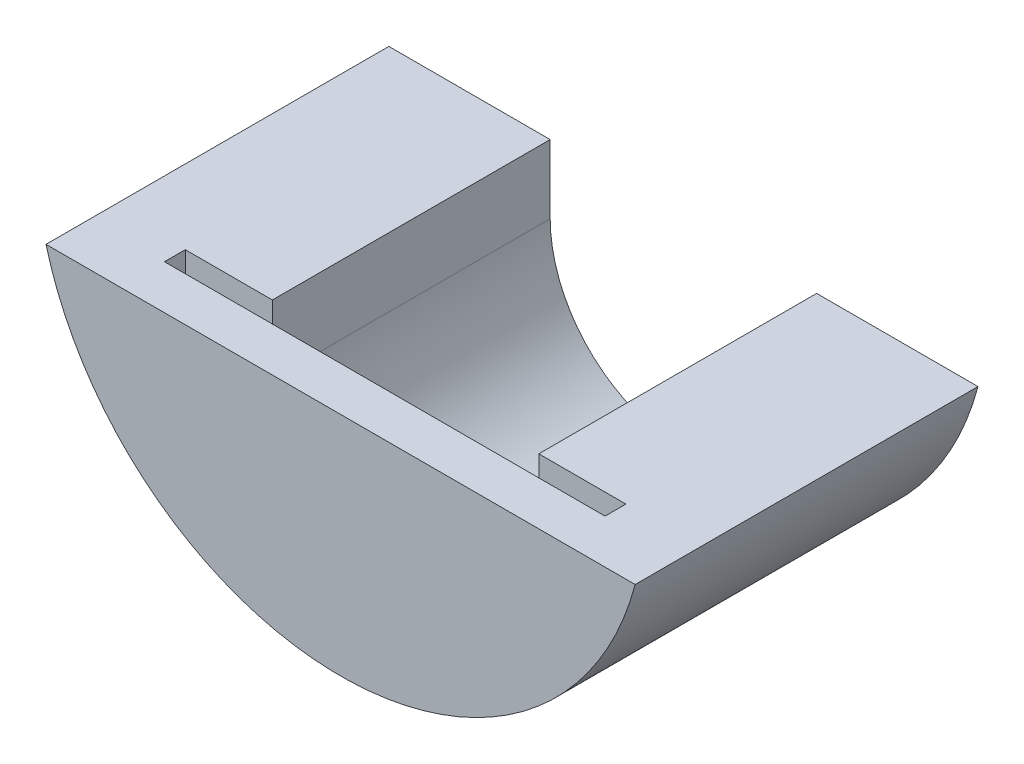
ISO-10303-21;
HEADER;
FILE_DESCRIPTION(('STEP AP214'),'2;1');
FILE_NAME('part.step','',(''),(''),'','','');
FILE_SCHEMA(('AUTOMOTIVE_DESIGN { 1 0 10303 214 1 1 1 1 }'));
ENDSEC;
DATA;
#1=APPLICATION_CONTEXT('core data for automotive mechanical design processes');
#2=APPLICATION_PROTOCOL_DEFINITION('international standard','automotive_design',2000,#1);
#3=PRODUCT_CONTEXT('',#1,'mechanical');
#4=PRODUCT('Part','Part','',(#3));
#5=PRODUCT_RELATED_PRODUCT_CATEGORY('part','',(#4));
#6=PRODUCT_DEFINITION_FORMATION('','',#4);
#7=PRODUCT_DEFINITION_CONTEXT('part definition',#1,'design');
#8=PRODUCT_DEFINITION('design','',#6,#7);
#9=PRODUCT_DEFINITION_SHAPE('','',#8);
#10=(LENGTH_UNIT() NAMED_UNIT(*) SI_UNIT(.MILLI.,.METRE.));
#11=(NAMED_UNIT(*) PLANE_ANGLE_UNIT() SI_UNIT($,.RADIAN.));
#12=(NAMED_UNIT(*) SI_UNIT($,.STERADIAN.) SOLID_ANGLE_UNIT());
#13=UNCERTAINTY_MEASURE_WITH_UNIT(LENGTH_MEASURE(1.E-05),#10,'distance_accuracy_value','');
#14=(GEOMETRIC_REPRESENTATION_CONTEXT(3) GLOBAL_UNCERTAINTY_ASSIGNED_CONTEXT((#13)) GLOBAL_UNIT_ASSIGNED_CONTEXT((#10,
#11,#12)) REPRESENTATION_CONTEXT('',''));
#15=CARTESIAN_POINT('',(0.,0.,0.));
#16=DIRECTION('',(0.,0.,1.));
#17=DIRECTION('',(1.,0.,0.));
#18=AXIS2_PLACEMENT_3D('',#15,#16,#17);
#19=CARTESIAN_POINT('',(0.,0.,50.));
#20=DIRECTION('',(0.,0.,-1.));
#21=DIRECTION('',(-1.,0.,0.));
#22=AXIS2_PLACEMENT_3D('',#19,#20,#21);
#23=CYLINDRICAL_SURFACE('',#22,44.45);
#24=CARTESIAN_POINT('',(0.,0.,0.));
#25=DIRECTION('',(0.,0.,1.));
#26=DIRECTION('',(1.,0.,0.));
#27=AXIS2_PLACEMENT_3D('',#24,#25,#26);
#28=CIRCLE('',#27,44.45);
#29=CARTESIAN_POINT('',(-42.9632691959073,-11.4,0.));
#30=VERTEX_POINT('',#29);
#31=CARTESIAN_POINT('',(42.9632691959073,-11.4,0.));
#32=VERTEX_POINT('',#31);
#33=EDGE_CURVE('E144',#30,#32,#28,.T.);
#34=ORIENTED_EDGE('',*,*,#33,.T.);
#35=DIRECTION('',(0.,0.,-1.));
#36=VECTOR('',#35,1.);
#37=CARTESIAN_POINT('',(42.9632691959073,-11.4,50.));
#38=LINE('',#37,#36);
#39=CARTESIAN_POINT('',(42.9632691959073,-11.4,50.));
#40=VERTEX_POINT('',#39);
#41=EDGE_CURVE('E147',#40,#32,#38,.T.);
#42=ORIENTED_EDGE('',*,*,#41,.F.);
#43=CARTESIAN_POINT('',(0.,0.,50.));
#44=DIRECTION('',(0.,0.,1.));
#45=DIRECTION('',(1.,0.,0.));
#46=AXIS2_PLACEMENT_3D('',#43,#44,#45);
#47=CIRCLE('',#46,44.45);
#48=CARTESIAN_POINT('',(-42.9632691959073,-11.4,50.));
#49=VERTEX_POINT('',#48);
#50=EDGE_CURVE('E50',#49,#40,#47,.T.);
#51=ORIENTED_EDGE('',*,*,#50,.F.);
#52=DIRECTION('',(0.,0.,-1.));
#53=VECTOR('',#52,1.);
#54=CARTESIAN_POINT('',(-42.9632691959073,-11.4,50.));
#55=LINE('',#54,#53);
#56=EDGE_CURVE('E149',#49,#30,#55,.T.);
#57=ORIENTED_EDGE('',*,*,#56,.T.);
#58=EDGE_LOOP('',(#34,#42,#51,#57));
#59=FACE_BOUND('',#58,.T.);
#60=ADVANCED_FACE('F43',(#59),#23,.T.);
#61=CARTESIAN_POINT('',(0.,0.,50.));
#62=DIRECTION('',(0.,0.,1.));
#63=DIRECTION('',(1.,0.,0.));
#64=AXIS2_PLACEMENT_3D('',#61,#62,#63);
#65=PLANE('',#64);
#66=ORIENTED_EDGE('',*,*,#50,.T.);
#67=DIRECTION('',(1.,0.,0.));
#68=VECTOR('',#67,1.);
#69=CARTESIAN_POINT('',(-38.9594982000539,-11.4,50.));
#70=LINE('',#69,#68);
#71=EDGE_CURVE('E166',#49,#40,#70,.T.);
#72=ORIENTED_EDGE('',*,*,#71,.F.);
#73=EDGE_LOOP('',(#66,#72));
#74=FACE_BOUND('',#73,.T.);
#75=ADVANCED_FACE('F255',(#74),#65,.T.);
#76=CARTESIAN_POINT('',(0.,0.,0.));
#77=DIRECTION('',(0.,0.,1.));
#78=DIRECTION('',(1.,0.,0.));
#79=AXIS2_PLACEMENT_3D('',#76,#77,#78);
#80=PLANE('',#79);
#81=CARTESIAN_POINT('',(0.,-21.4,0.));
#82=DIRECTION('',(0.,0.,1.));
#83=DIRECTION('',(1.,0.,0.));
#84=AXIS2_PLACEMENT_3D('',#81,#82,#83);
#85=CIRCLE('',#84,19.431);
#86=CARTESIAN_POINT('',(19.431,-21.4,0.));
#87=VERTEX_POINT('',#86);
#88=CARTESIAN_POINT('',(-19.431,-21.4,0.));
#89=VERTEX_POINT('',#88);
#90=EDGE_CURVE('E11',#87,#89,#85,.F.);
#91=ORIENTED_EDGE('',*,*,#90,.F.);
#92=DIRECTION('',(0.,-1.,0.));
#93=VECTOR('',#92,1.);
#94=CARTESIAN_POINT('',(19.431,-11.4,0.));
#95=LINE('',#94,#93);
#96=CARTESIAN_POINT('',(19.431,-11.4,0.));
#97=VERTEX_POINT('',#96);
#98=EDGE_CURVE('E157',#97,#87,#95,.T.);
#99=ORIENTED_EDGE('',*,*,#98,.F.);
#100=DIRECTION('',(-1.,0.,0.));
#101=VECTOR('',#100,1.);
#102=CARTESIAN_POINT('',(38.9594982000539,-11.4,0.));
#103=LINE('',#102,#101);
#104=EDGE_CURVE('E154',#32,#97,#103,.T.);
#105=ORIENTED_EDGE('',*,*,#104,.F.);
#106=ORIENTED_EDGE('',*,*,#33,.F.);
#107=DIRECTION('',(-1.,0.,0.));
#108=VECTOR('',#107,1.);
#109=CARTESIAN_POINT('',(-19.431,-11.4,0.));
#110=LINE('',#109,#108);
#111=CARTESIAN_POINT('',(-19.431,-11.4,0.));
#112=VERTEX_POINT('',#111);
#113=EDGE_CURVE('E211',#112,#30,#110,.T.);
#114=ORIENTED_EDGE('',*,*,#113,.F.);
#115=DIRECTION('',(0.,-1.,0.));
#116=VECTOR('',#115,1.);
#117=CARTESIAN_POINT('',(-19.431,-11.4,0.));
#118=LINE('',#117,#116);
#119=EDGE_CURVE('E214',#112,#89,#118,.T.);
#120=ORIENTED_EDGE('',*,*,#119,.T.);
#121=EDGE_LOOP('',(#91,#99,#105,#106,#114,#120));
#122=FACE_BOUND('',#121,.T.);
#123=ADVANCED_FACE('F156',(#122),#80,.F.);
#124=CARTESIAN_POINT('',(0.,-21.4,41.5400000000001));
#125=DIRECTION('',(0.,0.,-1.));
#126=DIRECTION('',(-1.,0.,0.));
#127=AXIS2_PLACEMENT_3D('',#124,#125,#126);
#128=CYLINDRICAL_SURFACE('',#127,19.431);
#129=DIRECTION('',(0.,0.,-1.));
#130=VECTOR('',#129,1.);
#131=CARTESIAN_POINT('',(19.431,-21.4,50.));
#132=LINE('',#131,#130);
#133=CARTESIAN_POINT('',(19.431,-21.4,40.5200000000001));
#134=VERTEX_POINT('',#133);
#135=EDGE_CURVE('E224',#134,#87,#132,.T.);
#136=ORIENTED_EDGE('',*,*,#135,.T.);
#137=ORIENTED_EDGE('',*,*,#90,.T.);
#138=DIRECTION('',(0.,0.,-1.));
#139=VECTOR('',#138,1.);
#140=CARTESIAN_POINT('',(-19.431,-21.4,50.));
#141=LINE('',#140,#139);
#142=CARTESIAN_POINT('',(-19.431,-21.4,40.5200000000001));
#143=VERTEX_POINT('',#142);
#144=EDGE_CURVE('E223',#143,#89,#141,.T.);
#145=ORIENTED_EDGE('',*,*,#144,.F.);
#146=CARTESIAN_POINT('',(0.,-21.4,40.5200000000001));
#147=DIRECTION('',(0.,0.,1.));
#148=DIRECTION('',(1.,0.,0.));
#149=AXIS2_PLACEMENT_3D('',#146,#147,#148);
#150=CIRCLE('',#149,19.431);
#151=EDGE_CURVE('E152',#143,#134,#150,.T.);
#152=ORIENTED_EDGE('',*,*,#151,.T.);
#153=EDGE_LOOP('',(#136,#137,#145,#152));
#154=FACE_BOUND('',#153,.T.);
#155=ADVANCED_FACE('F263',(#154),#128,.F.);
#156=CARTESIAN_POINT('',(-15.555,-21.4,42.5600000000001));
#157=DIRECTION('',(0.,0.,-1.));
#158=DIRECTION('',(-1.,0.,0.));
#159=AXIS2_PLACEMENT_3D('',#156,#157,#158);
#160=CYLINDRICAL_SURFACE('',#159,16.575);
#161=DIRECTION('',(0.,0.,-1.));
#162=VECTOR('',#161,1.);
#163=CARTESIAN_POINT('',(-32.13,-21.4,42.5600000000001));
#164=LINE('',#163,#162);
#165=CARTESIAN_POINT('',(-32.13,-21.4,43.5600000000001));
#166=VERTEX_POINT('',#165);
#167=CARTESIAN_POINT('',(-32.13,-21.4,40.5200000000001));
#168=VERTEX_POINT('',#167);
#169=EDGE_CURVE('E227',#166,#168,#164,.T.);
#170=ORIENTED_EDGE('',*,*,#169,.F.);
#171=CARTESIAN_POINT('',(-15.555,-21.4,43.5600000000001));
#172=DIRECTION('',(0.,0.,-1.));
#173=DIRECTION('',(-1.,0.,0.));
#174=AXIS2_PLACEMENT_3D('',#171,#172,#173);
#175=CIRCLE('',#174,16.575);
#176=CARTESIAN_POINT('',(-21.93,-36.7,43.5600000000001));
#177=VERTEX_POINT('',#176);
#178=EDGE_CURVE('E186',#177,#166,#175,.T.);
#179=ORIENTED_EDGE('',*,*,#178,.F.);
#180=DIRECTION('',(0.,0.,-1.));
#181=VECTOR('',#180,1.);
#182=CARTESIAN_POINT('',(-21.93,-36.7,42.5600000000001));
#183=LINE('',#182,#181);
#184=CARTESIAN_POINT('',(-21.93,-36.7,40.5200000000001));
#185=VERTEX_POINT('',#184);
#186=EDGE_CURVE('E250',#177,#185,#183,.T.);
#187=ORIENTED_EDGE('',*,*,#186,.T.);
#188=CARTESIAN_POINT('',(-15.555,-21.4,40.5200000000001));
#189=DIRECTION('',(0.,0.,1.));
#190=DIRECTION('',(1.,0.,0.));
#191=AXIS2_PLACEMENT_3D('',#188,#189,#190);
#192=CIRCLE('',#191,16.575);
#193=EDGE_CURVE('E57',#168,#185,#192,.T.);
#194=ORIENTED_EDGE('',*,*,#193,.F.);
#195=EDGE_LOOP('',(#170,#179,#187,#194));
#196=FACE_BOUND('',#195,.T.);
#197=ADVANCED_FACE('F286',(#196),#160,.F.);
#198=CARTESIAN_POINT('',(-6.81688082386147,-41.7601074857985,42.5600000000001));
#199=DIRECTION('',(0.31749247002289,0.94826079296719,0.));
#200=DIRECTION('',(-0.94826079296719,0.31749247002289,0.));
#201=AXIS2_PLACEMENT_3D('',#198,#199,#200);
#202=PLANE('',#201);
#203=ORIENTED_EDGE('',*,*,#186,.F.);
#204=DIRECTION('',(-0.94826079296719,0.317492470022889,0.));
#205=VECTOR('',#204,1.);
#206=CARTESIAN_POINT('',(-6.81688082386148,-41.7601074857985,43.5600000000001));
#207=LINE('',#206,#205);
#208=CARTESIAN_POINT('',(-6.81688082386147,-41.7601074857985,43.5600000000001));
#209=VERTEX_POINT('',#208);
#210=EDGE_CURVE('E183',#209,#177,#207,.T.);
#211=ORIENTED_EDGE('',*,*,#210,.F.);
#212=DIRECTION('',(0.,0.,-1.));
#213=VECTOR('',#212,1.);
#214=CARTESIAN_POINT('',(-6.81688082386148,-41.7601074857985,42.5600000000001));
#215=LINE('',#214,#213);
#216=CARTESIAN_POINT('',(-6.81688082386148,-41.7601074857985,40.5200000000001));
#217=VERTEX_POINT('',#216);
#218=EDGE_CURVE('E248',#209,#217,#215,.T.);
#219=ORIENTED_EDGE('',*,*,#218,.T.);
#220=DIRECTION('',(0.94826079296719,-0.31749247002289,0.));
#221=VECTOR('',#220,1.);
#222=CARTESIAN_POINT('',(-6.81688082386147,-41.7601074857985,40.5200000000001));
#223=LINE('',#222,#221);
#224=EDGE_CURVE('E234',#185,#217,#223,.T.);
#225=ORIENTED_EDGE('',*,*,#224,.F.);
#226=EDGE_LOOP('',(#203,#211,#219,#225));
#227=FACE_BOUND('',#226,.T.);
#228=ADVANCED_FACE('F289',(#227),#202,.T.);
#229=CARTESIAN_POINT('',(0.,-21.4,42.5600000000001));
#230=DIRECTION('',(0.,0.,-1.));
#231=DIRECTION('',(-1.,0.,0.));
#232=AXIS2_PLACEMENT_3D('',#229,#230,#231);
#233=CYLINDRICAL_SURFACE('',#232,21.471);
#234=ORIENTED_EDGE('',*,*,#218,.F.);
#235=CARTESIAN_POINT('',(0.,-21.4,43.5600000000001));
#236=DIRECTION('',(0.,0.,-1.));
#237=DIRECTION('',(-1.,0.,0.));
#238=AXIS2_PLACEMENT_3D('',#235,#236,#237);
#239=CIRCLE('',#238,21.471);
#240=CARTESIAN_POINT('',(6.81688082386162,-41.7601074857985,43.5600000000001));
#241=VERTEX_POINT('',#240);
#242=EDGE_CURVE('E180',#241,#209,#239,.T.);
#243=ORIENTED_EDGE('',*,*,#242,.F.);
#244=DIRECTION('',(0.,0.,-1.));
#245=VECTOR('',#244,1.);
#246=CARTESIAN_POINT('',(6.81688082386162,-41.7601074857985,42.5600000000001));
#247=LINE('',#246,#245);
#248=CARTESIAN_POINT('',(6.81688082386162,-41.7601074857985,40.5200000000001));
#249=VERTEX_POINT('',#248);
#250=EDGE_CURVE('E246',#241,#249,#247,.T.);
#251=ORIENTED_EDGE('',*,*,#250,.T.);
#252=CARTESIAN_POINT('',(0.,-21.4,40.5200000000001));
#253=DIRECTION('',(0.,0.,1.));
#254=DIRECTION('',(1.,0.,0.));
#255=AXIS2_PLACEMENT_3D('',#252,#253,#254);
#256=CIRCLE('',#255,21.471);
#257=EDGE_CURVE('E237',#217,#249,#256,.T.);
#258=ORIENTED_EDGE('',*,*,#257,.F.);
#259=EDGE_LOOP('',(#234,#243,#251,#258));
#260=FACE_BOUND('',#259,.T.);
#261=ADVANCED_FACE('F293',(#260),#233,.F.);
#262=CARTESIAN_POINT('',(6.81688082386177,-41.7601074857984,42.5600000000001));
#263=DIRECTION('',(0.317492470022903,-0.948260792967186,0.));
#264=DIRECTION('',(0.948260792967186,0.317492470022903,0.));
#265=AXIS2_PLACEMENT_3D('',#262,#263,#264);
#266=PLANE('',#265);
#267=ORIENTED_EDGE('',*,*,#250,.F.);
#268=DIRECTION('',(-0.948260792967186,-0.317492470022902,0.));
#269=VECTOR('',#268,1.);
#270=CARTESIAN_POINT('',(21.9300000000001,-36.6999999999998,43.5600000000001));
#271=LINE('',#270,#269);
#272=CARTESIAN_POINT('',(21.9300000000001,-36.6999999999998,43.5600000000001));
#273=VERTEX_POINT('',#272);
#274=EDGE_CURVE('E177',#273,#241,#271,.T.);
#275=ORIENTED_EDGE('',*,*,#274,.F.);
#276=DIRECTION('',(0.,0.,-1.));
#277=VECTOR('',#276,1.);
#278=CARTESIAN_POINT('',(21.9300000000001,-36.6999999999998,42.5600000000001));
#279=LINE('',#278,#277);
#280=CARTESIAN_POINT('',(21.9300000000001,-36.6999999999998,40.5200000000001));
#281=VERTEX_POINT('',#280);
#282=EDGE_CURVE('E244',#273,#281,#279,.T.);
#283=ORIENTED_EDGE('',*,*,#282,.T.);
#284=DIRECTION('',(-0.948260792967186,-0.317492470022903,0.));
#285=VECTOR('',#284,1.);
#286=CARTESIAN_POINT('',(6.81688082386177,-41.7601074857984,40.5200000000001));
#287=LINE('',#286,#285);
#288=EDGE_CURVE('E240',#281,#249,#287,.T.);
#289=ORIENTED_EDGE('',*,*,#288,.T.);
#290=EDGE_LOOP('',(#267,#275,#283,#289));
#291=FACE_BOUND('',#290,.T.);
#292=ADVANCED_FACE('F295',(#291),#266,.F.);
#293=CARTESIAN_POINT('',(15.555,-21.4,42.5600000000001));
#294=DIRECTION('',(0.,0.,-1.));
#295=DIRECTION('',(-1.,0.,0.));
#296=AXIS2_PLACEMENT_3D('',#293,#294,#295);
#297=CYLINDRICAL_SURFACE('',#296,16.5749999999999);
#298=ORIENTED_EDGE('',*,*,#282,.F.);
#299=CARTESIAN_POINT('',(15.555,-21.4,43.5600000000001));
#300=DIRECTION('',(0.,0.,-1.));
#301=DIRECTION('',(-1.,0.,0.));
#302=AXIS2_PLACEMENT_3D('',#299,#300,#301);
#303=CIRCLE('',#302,16.5749999999999);
#304=CARTESIAN_POINT('',(32.1299999999999,-21.4,43.5600000000001));
#305=VERTEX_POINT('',#304);
#306=EDGE_CURVE('E174',#305,#273,#303,.T.);
#307=ORIENTED_EDGE('',*,*,#306,.F.);
#308=DIRECTION('',(0.,0.,-1.));
#309=VECTOR('',#308,1.);
#310=CARTESIAN_POINT('',(32.1299999999999,-21.4,42.5600000000001));
#311=LINE('',#310,#309);
#312=CARTESIAN_POINT('',(32.1299999999999,-21.4,40.5200000000001));
#313=VERTEX_POINT('',#312);
#314=EDGE_CURVE('E231',#305,#313,#311,.T.);
#315=ORIENTED_EDGE('',*,*,#314,.T.);
#316=CARTESIAN_POINT('',(15.555,-21.4,40.5200000000001));
#317=DIRECTION('',(0.,0.,1.));
#318=DIRECTION('',(1.,0.,0.));
#319=AXIS2_PLACEMENT_3D('',#316,#317,#318);
#320=CIRCLE('',#319,16.5749999999999);
#321=EDGE_CURVE('E65',#313,#281,#320,.F.);
#322=ORIENTED_EDGE('',*,*,#321,.T.);
#323=EDGE_LOOP('',(#298,#307,#315,#322));
#324=FACE_BOUND('',#323,.T.);
#325=ADVANCED_FACE('F297',(#324),#297,.F.);
#326=CARTESIAN_POINT('',(0.,-21.4,40.5200000000001));
#327=DIRECTION('',(0.,0.,1.));
#328=DIRECTION('',(1.,0.,0.));
#329=AXIS2_PLACEMENT_3D('',#326,#327,#328);
#330=PLANE('',#329);
#331=ORIENTED_EDGE('',*,*,#321,.F.);
#332=DIRECTION('',(0.,-1.,0.));
#333=VECTOR('',#332,1.);
#334=CARTESIAN_POINT('',(32.1299999999999,-11.4,40.5200000000001));
#335=LINE('',#334,#333);
#336=CARTESIAN_POINT('',(32.1299999999999,-11.4,40.5200000000001));
#337=VERTEX_POINT('',#336);
#338=EDGE_CURVE('E198',#337,#313,#335,.T.);
#339=ORIENTED_EDGE('',*,*,#338,.F.);
#340=DIRECTION('',(1.,0.,0.));
#341=VECTOR('',#340,1.);
#342=CARTESIAN_POINT('',(19.431,-11.4,40.5200000000001));
#343=LINE('',#342,#341);
#344=CARTESIAN_POINT('',(19.431,-11.4,40.5200000000001));
#345=VERTEX_POINT('',#344);
#346=EDGE_CURVE('E203',#345,#337,#343,.T.);
#347=ORIENTED_EDGE('',*,*,#346,.F.);
#348=DIRECTION('',(0.,-1.,0.));
#349=VECTOR('',#348,1.);
#350=CARTESIAN_POINT('',(19.431,-11.4,40.5200000000001));
#351=LINE('',#350,#349);
#352=EDGE_CURVE('E195',#345,#134,#351,.T.);
#353=ORIENTED_EDGE('',*,*,#352,.T.);
#354=ORIENTED_EDGE('',*,*,#151,.F.);
#355=DIRECTION('',(0.,-1.,0.));
#356=VECTOR('',#355,1.);
#357=CARTESIAN_POINT('',(-19.431,-11.4,40.5200000000001));
#358=LINE('',#357,#356);
#359=CARTESIAN_POINT('',(-19.431,-11.4,40.5200000000001));
#360=VERTEX_POINT('',#359);
#361=EDGE_CURVE('E217',#360,#143,#358,.T.);
#362=ORIENTED_EDGE('',*,*,#361,.F.);
#363=DIRECTION('',(1.,0.,0.));
#364=VECTOR('',#363,1.);
#365=CARTESIAN_POINT('',(-32.13,-11.4,40.5200000000001));
#366=LINE('',#365,#364);
#367=CARTESIAN_POINT('',(-32.13,-11.4,40.5200000000001));
#368=VERTEX_POINT('',#367);
#369=EDGE_CURVE('E207',#368,#360,#366,.T.);
#370=ORIENTED_EDGE('',*,*,#369,.F.);
#371=DIRECTION('',(0.,-1.,0.));
#372=VECTOR('',#371,1.);
#373=CARTESIAN_POINT('',(-32.13,-11.4,40.5200000000001));
#374=LINE('',#373,#372);
#375=EDGE_CURVE('E220',#368,#168,#374,.T.);
#376=ORIENTED_EDGE('',*,*,#375,.T.);
#377=ORIENTED_EDGE('',*,*,#193,.T.);
#378=ORIENTED_EDGE('',*,*,#224,.T.);
#379=ORIENTED_EDGE('',*,*,#257,.T.);
#380=ORIENTED_EDGE('',*,*,#288,.F.);
#381=EDGE_LOOP('',(#331,#339,#347,#353,#354,#362,#370,#376,#377,#378,#379,#380));
#382=FACE_BOUND('',#381,.T.);
#383=ADVANCED_FACE('F265',(#382),#330,.T.);
#384=CARTESIAN_POINT('',(-32.13,-11.4,42.5600000000001));
#385=DIRECTION('',(-1.,0.,0.));
#386=DIRECTION('',(0.,0.,1.));
#387=AXIS2_PLACEMENT_3D('',#384,#385,#386);
#388=PLANE('',#387);
#389=ORIENTED_EDGE('',*,*,#169,.T.);
#390=ORIENTED_EDGE('',*,*,#375,.F.);
#391=DIRECTION('',(0.,0.,-1.));
#392=VECTOR('',#391,1.);
#393=CARTESIAN_POINT('',(-32.13,-11.4,42.5600000000001));
#394=LINE('',#393,#392);
#395=CARTESIAN_POINT('',(-32.13,-11.4,43.5600000000001));
#396=VERTEX_POINT('',#395);
#397=EDGE_CURVE('E160',#396,#368,#394,.T.);
#398=ORIENTED_EDGE('',*,*,#397,.F.);
#399=DIRECTION('',(0.,1.,0.));
#400=VECTOR('',#399,1.);
#401=CARTESIAN_POINT('',(-32.13,-21.4,43.5600000000001));
#402=LINE('',#401,#400);
#403=EDGE_CURVE('E189',#166,#396,#402,.T.);
#404=ORIENTED_EDGE('',*,*,#403,.F.);
#405=EDGE_LOOP('',(#389,#390,#398,#404));
#406=FACE_BOUND('',#405,.T.);
#407=ADVANCED_FACE('F283',(#406),#388,.F.);
#408=CARTESIAN_POINT('',(-19.431,-11.4,40.5200000000001));
#409=DIRECTION('',(-1.,0.,0.));
#410=DIRECTION('',(0.,0.,1.));
#411=AXIS2_PLACEMENT_3D('',#408,#409,#410);
#412=PLANE('',#411);
#413=ORIENTED_EDGE('',*,*,#144,.T.);
#414=ORIENTED_EDGE('',*,*,#119,.F.);
#415=DIRECTION('',(0.,0.,-1.));
#416=VECTOR('',#415,1.);
#417=CARTESIAN_POINT('',(-19.431,-11.4,40.5200000000001));
#418=LINE('',#417,#416);
#419=EDGE_CURVE('E209',#360,#112,#418,.T.);
#420=ORIENTED_EDGE('',*,*,#419,.F.);
#421=ORIENTED_EDGE('',*,*,#361,.T.);
#422=EDGE_LOOP('',(#413,#414,#420,#421));
#423=FACE_BOUND('',#422,.T.);
#424=ADVANCED_FACE('F259',(#423),#412,.F.);
#425=CARTESIAN_POINT('',(0.,-11.4,0.));
#426=DIRECTION('',(0.,-1.,0.));
#427=DIRECTION('',(0.,0.,-1.));
#428=AXIS2_PLACEMENT_3D('',#425,#426,#427);
#429=PLANE('',#428);
#430=DIRECTION('',(1.,0.,0.));
#431=VECTOR('',#430,1.);
#432=CARTESIAN_POINT('',(-32.13,-11.4,43.5600000000001));
#433=LINE('',#432,#431);
#434=CARTESIAN_POINT('',(32.1299999999999,-11.4,43.5600000000001));
#435=VERTEX_POINT('',#434);
#436=EDGE_CURVE('E192',#396,#435,#433,.T.);
#437=ORIENTED_EDGE('',*,*,#436,.F.);
#438=ORIENTED_EDGE('',*,*,#397,.T.);
#439=ORIENTED_EDGE('',*,*,#369,.T.);
#440=ORIENTED_EDGE('',*,*,#419,.T.);
#441=ORIENTED_EDGE('',*,*,#113,.T.);
#442=ORIENTED_EDGE('',*,*,#56,.F.);
#443=ORIENTED_EDGE('',*,*,#71,.T.);
#444=ORIENTED_EDGE('',*,*,#41,.T.);
#445=ORIENTED_EDGE('',*,*,#104,.T.);
#446=DIRECTION('',(0.,0.,1.));
#447=VECTOR('',#446,1.);
#448=CARTESIAN_POINT('',(19.431,-11.4,0.));
#449=LINE('',#448,#447);
#450=EDGE_CURVE('E161',#97,#345,#449,.T.);
#451=ORIENTED_EDGE('',*,*,#450,.T.);
#452=ORIENTED_EDGE('',*,*,#346,.T.);
#453=DIRECTION('',(0.,0.,1.));
#454=VECTOR('',#453,1.);
#455=CARTESIAN_POINT('',(32.1299999999999,-11.4,40.5200000000001));
#456=LINE('',#455,#454);
#457=EDGE_CURVE('E200',#337,#435,#456,.T.);
#458=ORIENTED_EDGE('',*,*,#457,.T.);
#459=EDGE_LOOP('',(#437,#438,#439,#440,#441,#442,#443,#444,#445,#451,#452,#458));
#460=FACE_BOUND('',#459,.T.);
#461=ADVANCED_FACE('F164',(#460),#429,.F.);
#462=CARTESIAN_POINT('',(19.431,-11.4,0.));
#463=DIRECTION('',(1.,0.,0.));
#464=DIRECTION('',(0.,0.,-1.));
#465=AXIS2_PLACEMENT_3D('',#462,#463,#464);
#466=PLANE('',#465);
#467=ORIENTED_EDGE('',*,*,#135,.F.);
#468=ORIENTED_EDGE('',*,*,#352,.F.);
#469=ORIENTED_EDGE('',*,*,#450,.F.);
#470=ORIENTED_EDGE('',*,*,#98,.T.);
#471=EDGE_LOOP('',(#467,#468,#469,#470));
#472=FACE_BOUND('',#471,.T.);
#473=ADVANCED_FACE('F271',(#472),#466,.F.);
#474=CARTESIAN_POINT('',(32.1299999999999,-11.4,40.5200000000001));
#475=DIRECTION('',(1.,0.,0.));
#476=DIRECTION('',(0.,0.,-1.));
#477=AXIS2_PLACEMENT_3D('',#474,#475,#476);
#478=PLANE('',#477);
#479=ORIENTED_EDGE('',*,*,#314,.F.);
#480=DIRECTION('',(0.,-1.,0.));
#481=VECTOR('',#480,1.);
#482=CARTESIAN_POINT('',(32.1299999999999,-11.4,43.5600000000001));
#483=LINE('',#482,#481);
#484=EDGE_CURVE('E169',#435,#305,#483,.T.);
#485=ORIENTED_EDGE('',*,*,#484,.F.);
#486=ORIENTED_EDGE('',*,*,#457,.F.);
#487=ORIENTED_EDGE('',*,*,#338,.T.);
#488=EDGE_LOOP('',(#479,#485,#486,#487));
#489=FACE_BOUND('',#488,.T.);
#490=ADVANCED_FACE('F276',(#489),#478,.F.);
#491=CARTESIAN_POINT('',(0.,-21.4,43.5600000000001));
#492=DIRECTION('',(0.,0.,-1.));
#493=DIRECTION('',(-1.,0.,0.));
#494=AXIS2_PLACEMENT_3D('',#491,#492,#493);
#495=PLANE('',#494);
#496=ORIENTED_EDGE('',*,*,#436,.T.);
#497=ORIENTED_EDGE('',*,*,#484,.T.);
#498=ORIENTED_EDGE('',*,*,#306,.T.);
#499=ORIENTED_EDGE('',*,*,#274,.T.);
#500=ORIENTED_EDGE('',*,*,#242,.T.);
#501=ORIENTED_EDGE('',*,*,#210,.T.);
#502=ORIENTED_EDGE('',*,*,#178,.T.);
#503=ORIENTED_EDGE('',*,*,#403,.T.);
#504=EDGE_LOOP('',(#496,#497,#498,#499,#500,#501,#502,#503));
#505=FACE_BOUND('',#504,.T.);
#506=ADVANCED_FACE('F279',(#505),#495,.T.);
#507=CLOSED_SHELL('',(#60,#75,#123,#155,#197,#228,#261,#292,#325,#383,#407,#424,#461,#473,#490,#506));
#508=MANIFOLD_SOLID_BREP('B2',#507);
#509=ADVANCED_BREP_SHAPE_REPRESENTATION('',(#18,#508),#14);
#510=SHAPE_DEFINITION_REPRESENTATION(#9,#509);
ENDSEC;
END-ISO-10303-21;
